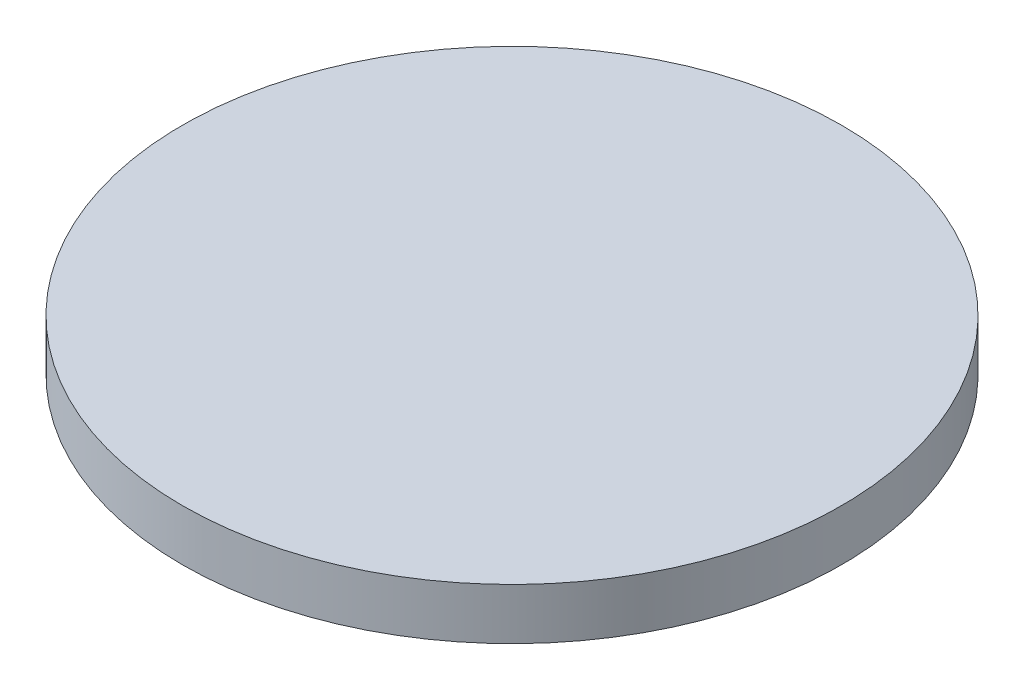
ISO-10303-21;
HEADER;
FILE_DESCRIPTION(('STEP AP214'),'2;1');
FILE_NAME('part.step','',(''),(''),'','','');
FILE_SCHEMA(('AUTOMOTIVE_DESIGN { 1 0 10303 214 1 1 1 1 }'));
ENDSEC;
DATA;
#1=APPLICATION_CONTEXT('core data for automotive mechanical design processes');
#2=APPLICATION_PROTOCOL_DEFINITION('international standard','automotive_design',2000,#1);
#3=PRODUCT_CONTEXT('',#1,'mechanical');
#4=PRODUCT('Part','Part','',(#3));
#5=PRODUCT_RELATED_PRODUCT_CATEGORY('part','',(#4));
#6=PRODUCT_DEFINITION_FORMATION('','',#4);
#7=PRODUCT_DEFINITION_CONTEXT('part definition',#1,'design');
#8=PRODUCT_DEFINITION('design','',#6,#7);
#9=PRODUCT_DEFINITION_SHAPE('','',#8);
#10=(LENGTH_UNIT() NAMED_UNIT(*) SI_UNIT(.MILLI.,.METRE.));
#11=(NAMED_UNIT(*) PLANE_ANGLE_UNIT() SI_UNIT($,.RADIAN.));
#12=(NAMED_UNIT(*) SI_UNIT($,.STERADIAN.) SOLID_ANGLE_UNIT());
#13=UNCERTAINTY_MEASURE_WITH_UNIT(LENGTH_MEASURE(1.E-05),#10,'distance_accuracy_value','');
#14=(GEOMETRIC_REPRESENTATION_CONTEXT(3) GLOBAL_UNCERTAINTY_ASSIGNED_CONTEXT((#13)) GLOBAL_UNIT_ASSIGNED_CONTEXT((#10,
#11,#12)) REPRESENTATION_CONTEXT('',''));
#15=CARTESIAN_POINT('',(0.,0.,0.));
#16=DIRECTION('',(0.,0.,1.));
#17=DIRECTION('',(1.,0.,0.));
#18=AXIS2_PLACEMENT_3D('',#15,#16,#17);
#19=CARTESIAN_POINT('',(0.,17.78,0.));
#20=DIRECTION('',(0.,-1.,0.));
#21=DIRECTION('',(0.,0.,-1.));
#22=AXIS2_PLACEMENT_3D('',#19,#20,#21);
#23=CYLINDRICAL_SURFACE('',#22,114.3);
#24=CARTESIAN_POINT('',(0.,17.78,0.));
#25=DIRECTION('',(0.,1.,0.));
#26=DIRECTION('',(0.,0.,1.));
#27=AXIS2_PLACEMENT_3D('',#24,#25,#26);
#28=CIRCLE('',#27,114.3);
#29=CARTESIAN_POINT('',(0.,17.78,114.3));
#30=VERTEX_POINT('',#29);
#31=EDGE_CURVE('E10',#30,#30,#28,.T.);
#32=ORIENTED_EDGE('',*,*,#31,.F.);
#33=EDGE_LOOP('',(#32));
#34=FACE_BOUND('',#33,.T.);
#35=CARTESIAN_POINT('',(0.,0.,0.));
#36=DIRECTION('',(0.,1.,0.));
#37=DIRECTION('',(0.,0.,1.));
#38=AXIS2_PLACEMENT_3D('',#35,#36,#37);
#39=CIRCLE('',#38,114.3);
#40=CARTESIAN_POINT('',(0.,0.,114.3));
#41=VERTEX_POINT('',#40);
#42=EDGE_CURVE('E34',#41,#41,#39,.T.);
#43=ORIENTED_EDGE('',*,*,#42,.T.);
#44=EDGE_LOOP('',(#43));
#45=FACE_BOUND('',#44,.T.);
#46=ADVANCED_FACE('F31',(#34,#45),#23,.T.);
#47=CARTESIAN_POINT('',(0.,17.78,0.));
#48=DIRECTION('',(0.,1.,0.));
#49=DIRECTION('',(0.,0.,1.));
#50=AXIS2_PLACEMENT_3D('',#47,#48,#49);
#51=PLANE('',#50);
#52=ORIENTED_EDGE('',*,*,#31,.T.);
#53=EDGE_LOOP('',(#52));
#54=FACE_BOUND('',#53,.T.);
#55=ADVANCED_FACE('F46',(#54),#51,.T.);
#56=CARTESIAN_POINT('',(0.,0.,0.));
#57=DIRECTION('',(0.,1.,0.));
#58=DIRECTION('',(0.,0.,1.));
#59=AXIS2_PLACEMENT_3D('',#56,#57,#58);
#60=PLANE('',#59);
#61=ORIENTED_EDGE('',*,*,#42,.F.);
#62=EDGE_LOOP('',(#61));
#63=FACE_BOUND('',#62,.T.);
#64=ADVANCED_FACE('F44',(#63),#60,.F.);
#65=CLOSED_SHELL('',(#46,#55,#64));
#66=MANIFOLD_SOLID_BREP('B2',#65);
#67=ADVANCED_BREP_SHAPE_REPRESENTATION('',(#18,#66),#14);
#68=SHAPE_DEFINITION_REPRESENTATION(#9,#67);
ENDSEC;
END-ISO-10303-21;
